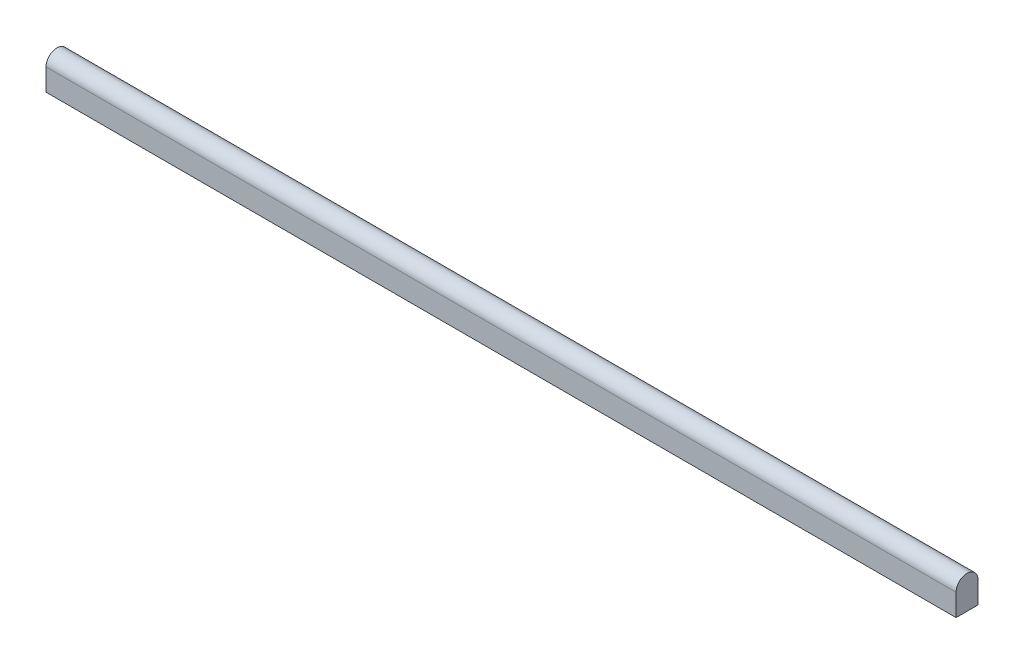
ISO-10303-21;
HEADER;
FILE_DESCRIPTION(('STEP AP214'),'2;1');
FILE_NAME('part.step','',(''),(''),'','','');
FILE_SCHEMA(('AUTOMOTIVE_DESIGN { 1 0 10303 214 1 1 1 1 }'));
ENDSEC;
DATA;
#1=APPLICATION_CONTEXT('core data for automotive mechanical design processes');
#2=APPLICATION_PROTOCOL_DEFINITION('international standard','automotive_design',2000,#1);
#3=PRODUCT_CONTEXT('',#1,'mechanical');
#4=PRODUCT('Part','Part','',(#3));
#5=PRODUCT_RELATED_PRODUCT_CATEGORY('part','',(#4));
#6=PRODUCT_DEFINITION_FORMATION('','',#4);
#7=PRODUCT_DEFINITION_CONTEXT('part definition',#1,'design');
#8=PRODUCT_DEFINITION('design','',#6,#7);
#9=PRODUCT_DEFINITION_SHAPE('','',#8);
#10=(LENGTH_UNIT() NAMED_UNIT(*) SI_UNIT(.MILLI.,.METRE.));
#11=(NAMED_UNIT(*) PLANE_ANGLE_UNIT() SI_UNIT($,.RADIAN.));
#12=(NAMED_UNIT(*) SI_UNIT($,.STERADIAN.) SOLID_ANGLE_UNIT());
#13=UNCERTAINTY_MEASURE_WITH_UNIT(LENGTH_MEASURE(1.E-05),#10,'distance_accuracy_value','');
#14=(GEOMETRIC_REPRESENTATION_CONTEXT(3) GLOBAL_UNCERTAINTY_ASSIGNED_CONTEXT((#13)) GLOBAL_UNIT_ASSIGNED_CONTEXT((#10,
#11,#12)) REPRESENTATION_CONTEXT('',''));
#15=CARTESIAN_POINT('',(0.,0.,0.));
#16=DIRECTION('',(0.,0.,1.));
#17=DIRECTION('',(1.,0.,0.));
#18=AXIS2_PLACEMENT_3D('',#15,#16,#17);
#19=CARTESIAN_POINT('',(10.,-3.,-1.));
#20=DIRECTION('',(0.,-1.,0.));
#21=DIRECTION('',(0.,0.,-1.));
#22=AXIS2_PLACEMENT_3D('',#19,#20,#21);
#23=PLANE('',#22);
#24=DIRECTION('',(0.,0.,1.));
#25=VECTOR('',#24,1.);
#26=CARTESIAN_POINT('',(10.,-3.,-1.));
#27=LINE('',#26,#25);
#28=CARTESIAN_POINT('',(10.,-3.,0.500000000000004));
#29=VERTEX_POINT('',#28);
#30=CARTESIAN_POINT('',(10.,-3.,1.));
#31=VERTEX_POINT('',#30);
#32=EDGE_CURVE('E213',#29,#31,#27,.T.);
#33=ORIENTED_EDGE('',*,*,#32,.F.);
#34=DIRECTION('',(-1.,0.,0.));
#35=VECTOR('',#34,1.);
#36=CARTESIAN_POINT('',(10.,-3.,0.500000000000004));
#37=LINE('',#36,#35);
#38=CARTESIAN_POINT('',(0.,-3.,0.5));
#39=VERTEX_POINT('',#38);
#40=EDGE_CURVE('E194',#29,#39,#37,.T.);
#41=ORIENTED_EDGE('',*,*,#40,.T.);
#42=DIRECTION('',(0.,0.,1.));
#43=VECTOR('',#42,1.);
#44=CARTESIAN_POINT('',(0.,-3.,-1.));
#45=LINE('',#44,#43);
#46=CARTESIAN_POINT('',(0.,-3.,1.));
#47=VERTEX_POINT('',#46);
#48=EDGE_CURVE('E186',#39,#47,#45,.T.);
#49=ORIENTED_EDGE('',*,*,#48,.T.);
#50=DIRECTION('',(-1.,0.,0.));
#51=VECTOR('',#50,1.);
#52=CARTESIAN_POINT('',(10.,-3.,1.));
#53=LINE('',#52,#51);
#54=EDGE_CURVE('E238',#31,#47,#53,.T.);
#55=ORIENTED_EDGE('',*,*,#54,.F.);
#56=EDGE_LOOP('',(#33,#41,#49,#55));
#57=FACE_BOUND('',#56,.T.);
#58=ADVANCED_FACE('F39',(#57),#23,.F.);
#59=CARTESIAN_POINT('',(166.,0.,0.));
#60=DIRECTION('',(-1.,0.,0.));
#61=DIRECTION('',(0.,0.,1.));
#62=AXIS2_PLACEMENT_3D('',#59,#60,#61);
#63=CYLINDRICAL_SURFACE('',#62,2.);
#64=CARTESIAN_POINT('',(0.,0.,0.));
#65=DIRECTION('',(1.,0.,0.));
#66=DIRECTION('',(0.,0.,1.));
#67=AXIS2_PLACEMENT_3D('',#64,#65,#66);
#68=CIRCLE('',#67,2.);
#69=CARTESIAN_POINT('',(0.,0.,-2.));
#70=VERTEX_POINT('',#69);
#71=CARTESIAN_POINT('',(0.,0.,2.));
#72=VERTEX_POINT('',#71);
#73=EDGE_CURVE('E162',#70,#72,#68,.T.);
#74=ORIENTED_EDGE('',*,*,#73,.T.);
#75=DIRECTION('',(-1.,0.,0.));
#76=VECTOR('',#75,1.);
#77=CARTESIAN_POINT('',(166.,0.,2.));
#78=LINE('',#77,#76);
#79=CARTESIAN_POINT('',(166.,0.,2.));
#80=VERTEX_POINT('',#79);
#81=EDGE_CURVE('E11',#80,#72,#78,.T.);
#82=ORIENTED_EDGE('',*,*,#81,.F.);
#83=CARTESIAN_POINT('',(166.,0.,0.));
#84=DIRECTION('',(1.,0.,0.));
#85=DIRECTION('',(0.,0.,1.));
#86=AXIS2_PLACEMENT_3D('',#83,#84,#85);
#87=CIRCLE('',#86,2.);
#88=CARTESIAN_POINT('',(166.,0.,-2.));
#89=VERTEX_POINT('',#88);
#90=EDGE_CURVE('E168',#89,#80,#87,.T.);
#91=ORIENTED_EDGE('',*,*,#90,.F.);
#92=DIRECTION('',(-1.,0.,0.));
#93=VECTOR('',#92,1.);
#94=CARTESIAN_POINT('',(166.,0.,-2.));
#95=LINE('',#94,#93);
#96=EDGE_CURVE('E169',#89,#70,#95,.T.);
#97=ORIENTED_EDGE('',*,*,#96,.T.);
#98=EDGE_LOOP('',(#74,#82,#91,#97));
#99=FACE_BOUND('',#98,.T.);
#100=ADVANCED_FACE('F41',(#99),#63,.T.);
#101=CARTESIAN_POINT('',(166.,0.,2.));
#102=DIRECTION('',(0.,0.,-1.));
#103=DIRECTION('',(0.,1.,0.));
#104=AXIS2_PLACEMENT_3D('',#101,#102,#103);
#105=PLANE('',#104);
#106=DIRECTION('',(0.,-1.,0.));
#107=VECTOR('',#106,1.);
#108=CARTESIAN_POINT('',(0.,0.,2.));
#109=LINE('',#108,#107);
#110=CARTESIAN_POINT('',(0.,-4.,2.));
#111=VERTEX_POINT('',#110);
#112=EDGE_CURVE('E158',#72,#111,#109,.T.);
#113=ORIENTED_EDGE('',*,*,#112,.T.);
#114=DIRECTION('',(-1.,0.,0.));
#115=VECTOR('',#114,1.);
#116=CARTESIAN_POINT('',(166.,-4.,2.));
#117=LINE('',#116,#115);
#118=CARTESIAN_POINT('',(166.,-4.,2.));
#119=VERTEX_POINT('',#118);
#120=EDGE_CURVE('E48',#119,#111,#117,.T.);
#121=ORIENTED_EDGE('',*,*,#120,.F.);
#122=DIRECTION('',(0.,-1.,0.));
#123=VECTOR('',#122,1.);
#124=CARTESIAN_POINT('',(166.,0.,2.));
#125=LINE('',#124,#123);
#126=EDGE_CURVE('E250',#80,#119,#125,.T.);
#127=ORIENTED_EDGE('',*,*,#126,.F.);
#128=ORIENTED_EDGE('',*,*,#81,.T.);
#129=EDGE_LOOP('',(#113,#121,#127,#128));
#130=FACE_BOUND('',#129,.T.);
#131=ADVANCED_FACE('F267',(#130),#105,.F.);
#132=CARTESIAN_POINT('',(166.,-4.,2.));
#133=DIRECTION('',(0.,1.,0.));
#134=DIRECTION('',(0.,0.,1.));
#135=AXIS2_PLACEMENT_3D('',#132,#133,#134);
#136=PLANE('',#135);
#137=DIRECTION('',(0.,0.,-1.));
#138=VECTOR('',#137,1.);
#139=CARTESIAN_POINT('',(0.,-4.,2.));
#140=LINE('',#139,#138);
#141=CARTESIAN_POINT('',(0.,-4.,0.5));
#142=VERTEX_POINT('',#141);
#143=EDGE_CURVE('E157',#111,#142,#140,.T.);
#144=ORIENTED_EDGE('',*,*,#143,.T.);
#145=DIRECTION('',(-1.,0.,0.));
#146=VECTOR('',#145,1.);
#147=CARTESIAN_POINT('',(0.,-4.,0.5));
#148=LINE('',#147,#146);
#149=CARTESIAN_POINT('',(10.,-4.,0.500000000000004));
#150=VERTEX_POINT('',#149);
#151=EDGE_CURVE('E138',#150,#142,#148,.T.);
#152=ORIENTED_EDGE('',*,*,#151,.F.);
#153=DIRECTION('',(0.,0.,1.));
#154=VECTOR('',#153,1.);
#155=CARTESIAN_POINT('',(10.,-4.,-0.5));
#156=LINE('',#155,#154);
#157=CARTESIAN_POINT('',(10.,-4.,-0.5));
#158=VERTEX_POINT('',#157);
#159=EDGE_CURVE('E148',#158,#150,#156,.T.);
#160=ORIENTED_EDGE('',*,*,#159,.F.);
#161=DIRECTION('',(1.,0.,0.));
#162=VECTOR('',#161,1.);
#163=CARTESIAN_POINT('',(0.,-4.,-0.5));
#164=LINE('',#163,#162);
#165=CARTESIAN_POINT('',(0.,-4.,-0.5));
#166=VERTEX_POINT('',#165);
#167=EDGE_CURVE('E130',#166,#158,#164,.T.);
#168=ORIENTED_EDGE('',*,*,#167,.F.);
#169=CARTESIAN_POINT('',(0.,-4.,-2.));
#170=VERTEX_POINT('',#169);
#171=EDGE_CURVE('E144',#166,#170,#140,.T.);
#172=ORIENTED_EDGE('',*,*,#171,.T.);
#173=DIRECTION('',(-1.,0.,0.));
#174=VECTOR('',#173,1.);
#175=CARTESIAN_POINT('',(166.,-4.,-2.));
#176=LINE('',#175,#174);
#177=CARTESIAN_POINT('',(166.,-4.,-2.));
#178=VERTEX_POINT('',#177);
#179=EDGE_CURVE('E173',#178,#170,#176,.T.);
#180=ORIENTED_EDGE('',*,*,#179,.F.);
#181=DIRECTION('',(0.,0.,-1.));
#182=VECTOR('',#181,1.);
#183=CARTESIAN_POINT('',(166.,-4.,2.));
#184=LINE('',#183,#182);
#185=EDGE_CURVE('E181',#119,#178,#184,.T.);
#186=ORIENTED_EDGE('',*,*,#185,.F.);
#187=ORIENTED_EDGE('',*,*,#120,.T.);
#188=EDGE_LOOP('',(#144,#152,#160,#168,#172,#180,#186,#187));
#189=FACE_BOUND('',#188,.T.);
#190=ADVANCED_FACE('F142',(#189),#136,.F.);
#191=CARTESIAN_POINT('',(166.,-4.,-2.));
#192=DIRECTION('',(0.,0.,1.));
#193=DIRECTION('',(0.,-1.,0.));
#194=AXIS2_PLACEMENT_3D('',#191,#192,#193);
#195=PLANE('',#194);
#196=DIRECTION('',(0.,1.,0.));
#197=VECTOR('',#196,1.);
#198=CARTESIAN_POINT('',(0.,-4.,-2.));
#199=LINE('',#198,#197);
#200=EDGE_CURVE('E155',#170,#70,#199,.T.);
#201=ORIENTED_EDGE('',*,*,#200,.T.);
#202=ORIENTED_EDGE('',*,*,#96,.F.);
#203=DIRECTION('',(0.,1.,0.));
#204=VECTOR('',#203,1.);
#205=CARTESIAN_POINT('',(166.,-4.,-2.));
#206=LINE('',#205,#204);
#207=EDGE_CURVE('E174',#178,#89,#206,.T.);
#208=ORIENTED_EDGE('',*,*,#207,.F.);
#209=ORIENTED_EDGE('',*,*,#179,.T.);
#210=EDGE_LOOP('',(#201,#202,#208,#209));
#211=FACE_BOUND('',#210,.T.);
#212=ADVANCED_FACE('F264',(#211),#195,.F.);
#213=CARTESIAN_POINT('',(166.,0.,0.));
#214=DIRECTION('',(-1.,0.,0.));
#215=DIRECTION('',(0.,0.,1.));
#216=AXIS2_PLACEMENT_3D('',#213,#214,#215);
#217=PLANE('',#216);
#218=ORIENTED_EDGE('',*,*,#90,.T.);
#219=ORIENTED_EDGE('',*,*,#126,.T.);
#220=ORIENTED_EDGE('',*,*,#185,.T.);
#221=ORIENTED_EDGE('',*,*,#207,.T.);
#222=EDGE_LOOP('',(#218,#219,#220,#221));
#223=FACE_BOUND('',#222,.T.);
#224=ADVANCED_FACE('F266',(#223),#217,.F.);
#225=CARTESIAN_POINT('',(0.,0.,0.));
#226=DIRECTION('',(-1.,0.,0.));
#227=DIRECTION('',(0.,0.,1.));
#228=AXIS2_PLACEMENT_3D('',#225,#226,#227);
#229=PLANE('',#228);
#230=DIRECTION('',(0.,-1.,0.));
#231=VECTOR('',#230,1.);
#232=CARTESIAN_POINT('',(0.,-2.,0.5));
#233=LINE('',#232,#231);
#234=EDGE_CURVE('E184',#39,#142,#233,.T.);
#235=ORIENTED_EDGE('',*,*,#234,.T.);
#236=ORIENTED_EDGE('',*,*,#143,.F.);
#237=ORIENTED_EDGE('',*,*,#112,.F.);
#238=ORIENTED_EDGE('',*,*,#73,.F.);
#239=ORIENTED_EDGE('',*,*,#200,.F.);
#240=ORIENTED_EDGE('',*,*,#171,.F.);
#241=DIRECTION('',(0.,-1.,0.));
#242=VECTOR('',#241,1.);
#243=CARTESIAN_POINT('',(0.,-2.,-0.5));
#244=LINE('',#243,#242);
#245=CARTESIAN_POINT('',(0.,-3.,-0.5));
#246=VERTEX_POINT('',#245);
#247=EDGE_CURVE('E127',#246,#166,#244,.T.);
#248=ORIENTED_EDGE('',*,*,#247,.F.);
#249=CARTESIAN_POINT('',(0.,-3.,-1.));
#250=VERTEX_POINT('',#249);
#251=EDGE_CURVE('E229',#250,#246,#45,.T.);
#252=ORIENTED_EDGE('',*,*,#251,.F.);
#253=DIRECTION('',(0.,-1.,0.));
#254=VECTOR('',#253,1.);
#255=CARTESIAN_POINT('',(0.,0.,-1.));
#256=LINE('',#255,#254);
#257=CARTESIAN_POINT('',(0.,0.,-1.));
#258=VERTEX_POINT('',#257);
#259=EDGE_CURVE('E225',#258,#250,#256,.T.);
#260=ORIENTED_EDGE('',*,*,#259,.F.);
#261=CARTESIAN_POINT('',(0.,0.,0.));
#262=DIRECTION('',(-1.,0.,0.));
#263=DIRECTION('',(0.,0.,1.));
#264=AXIS2_PLACEMENT_3D('',#261,#262,#263);
#265=CIRCLE('',#264,1.);
#266=CARTESIAN_POINT('',(0.,0.,1.));
#267=VERTEX_POINT('',#266);
#268=EDGE_CURVE('E63',#267,#258,#265,.T.);
#269=ORIENTED_EDGE('',*,*,#268,.F.);
#270=DIRECTION('',(0.,1.,0.));
#271=VECTOR('',#270,1.);
#272=CARTESIAN_POINT('',(0.,-3.,1.));
#273=LINE('',#272,#271);
#274=EDGE_CURVE('E209',#47,#267,#273,.T.);
#275=ORIENTED_EDGE('',*,*,#274,.F.);
#276=ORIENTED_EDGE('',*,*,#48,.F.);
#277=EDGE_LOOP('',(#235,#236,#237,#238,#239,#240,#248,#252,#260,#269,#275,#276));
#278=FACE_BOUND('',#277,.T.);
#279=ADVANCED_FACE('F153',(#278),#229,.T.);
#280=CARTESIAN_POINT('',(10.,0.,0.));
#281=DIRECTION('',(-1.,0.,0.));
#282=DIRECTION('',(0.,0.,1.));
#283=AXIS2_PLACEMENT_3D('',#280,#281,#282);
#284=CYLINDRICAL_SURFACE('',#283,1.);
#285=ORIENTED_EDGE('',*,*,#268,.T.);
#286=DIRECTION('',(-1.,0.,0.));
#287=VECTOR('',#286,1.);
#288=CARTESIAN_POINT('',(10.,0.,-1.));
#289=LINE('',#288,#287);
#290=CARTESIAN_POINT('',(10.,0.,-1.));
#291=VERTEX_POINT('',#290);
#292=EDGE_CURVE('E222',#291,#258,#289,.T.);
#293=ORIENTED_EDGE('',*,*,#292,.F.);
#294=CARTESIAN_POINT('',(10.,0.,0.));
#295=DIRECTION('',(-1.,0.,0.));
#296=DIRECTION('',(0.,0.,1.));
#297=AXIS2_PLACEMENT_3D('',#294,#295,#296);
#298=CIRCLE('',#297,1.);
#299=CARTESIAN_POINT('',(10.,0.,1.));
#300=VERTEX_POINT('',#299);
#301=EDGE_CURVE('E204',#300,#291,#298,.T.);
#302=ORIENTED_EDGE('',*,*,#301,.F.);
#303=DIRECTION('',(-1.,0.,0.));
#304=VECTOR('',#303,1.);
#305=CARTESIAN_POINT('',(10.,0.,1.));
#306=LINE('',#305,#304);
#307=EDGE_CURVE('E235',#300,#267,#306,.T.);
#308=ORIENTED_EDGE('',*,*,#307,.T.);
#309=EDGE_LOOP('',(#285,#293,#302,#308));
#310=FACE_BOUND('',#309,.T.);
#311=ADVANCED_FACE('F293',(#310),#284,.F.);
#312=CARTESIAN_POINT('',(10.,-3.,1.));
#313=DIRECTION('',(0.,0.,1.));
#314=DIRECTION('',(0.,-1.,0.));
#315=AXIS2_PLACEMENT_3D('',#312,#313,#314);
#316=PLANE('',#315);
#317=ORIENTED_EDGE('',*,*,#274,.T.);
#318=ORIENTED_EDGE('',*,*,#307,.F.);
#319=DIRECTION('',(0.,1.,0.));
#320=VECTOR('',#319,1.);
#321=CARTESIAN_POINT('',(10.,-3.,1.));
#322=LINE('',#321,#320);
#323=EDGE_CURVE('E218',#31,#300,#322,.T.);
#324=ORIENTED_EDGE('',*,*,#323,.F.);
#325=ORIENTED_EDGE('',*,*,#54,.T.);
#326=EDGE_LOOP('',(#317,#318,#324,#325));
#327=FACE_BOUND('',#326,.T.);
#328=ADVANCED_FACE('F285',(#327),#316,.F.);
#329=ORIENTED_EDGE('',*,*,#251,.T.);
#330=DIRECTION('',(1.,0.,0.));
#331=VECTOR('',#330,1.);
#332=CARTESIAN_POINT('',(10.,-3.,-0.5));
#333=LINE('',#332,#331);
#334=CARTESIAN_POINT('',(10.,-3.,-0.5));
#335=VERTEX_POINT('',#334);
#336=EDGE_CURVE('E132',#246,#335,#333,.T.);
#337=ORIENTED_EDGE('',*,*,#336,.T.);
#338=CARTESIAN_POINT('',(10.,-3.,-1.));
#339=VERTEX_POINT('',#338);
#340=EDGE_CURVE('E214',#339,#335,#27,.T.);
#341=ORIENTED_EDGE('',*,*,#340,.F.);
#342=DIRECTION('',(-1.,0.,0.));
#343=VECTOR('',#342,1.);
#344=CARTESIAN_POINT('',(10.,-3.,-1.));
#345=LINE('',#344,#343);
#346=EDGE_CURVE('E242',#339,#250,#345,.T.);
#347=ORIENTED_EDGE('',*,*,#346,.T.);
#348=EDGE_LOOP('',(#329,#337,#341,#347));
#349=FACE_BOUND('',#348,.T.);
#350=ADVANCED_FACE('F277',(#349),#23,.F.);
#351=CARTESIAN_POINT('',(10.,0.,-1.));
#352=DIRECTION('',(0.,0.,-1.));
#353=DIRECTION('',(0.,1.,0.));
#354=AXIS2_PLACEMENT_3D('',#351,#352,#353);
#355=PLANE('',#354);
#356=ORIENTED_EDGE('',*,*,#259,.T.);
#357=ORIENTED_EDGE('',*,*,#346,.F.);
#358=DIRECTION('',(0.,-1.,0.));
#359=VECTOR('',#358,1.);
#360=CARTESIAN_POINT('',(10.,0.,-1.));
#361=LINE('',#360,#359);
#362=EDGE_CURVE('E208',#291,#339,#361,.T.);
#363=ORIENTED_EDGE('',*,*,#362,.F.);
#364=ORIENTED_EDGE('',*,*,#292,.T.);
#365=EDGE_LOOP('',(#356,#357,#363,#364));
#366=FACE_BOUND('',#365,.T.);
#367=ADVANCED_FACE('F284',(#366),#355,.F.);
#368=CARTESIAN_POINT('',(10.,0.,0.));
#369=DIRECTION('',(-1.,0.,0.));
#370=DIRECTION('',(0.,0.,1.));
#371=AXIS2_PLACEMENT_3D('',#368,#369,#370);
#372=PLANE('',#371);
#373=ORIENTED_EDGE('',*,*,#340,.T.);
#374=DIRECTION('',(0.,-1.,0.));
#375=VECTOR('',#374,1.);
#376=CARTESIAN_POINT('',(10.,-2.,-0.5));
#377=LINE('',#376,#375);
#378=EDGE_CURVE('E55',#335,#158,#377,.T.);
#379=ORIENTED_EDGE('',*,*,#378,.T.);
#380=ORIENTED_EDGE('',*,*,#159,.T.);
#381=DIRECTION('',(0.,-1.,0.));
#382=VECTOR('',#381,1.);
#383=CARTESIAN_POINT('',(10.,-2.,0.500000000000004));
#384=LINE('',#383,#382);
#385=EDGE_CURVE('E190',#29,#150,#384,.T.);
#386=ORIENTED_EDGE('',*,*,#385,.F.);
#387=ORIENTED_EDGE('',*,*,#32,.T.);
#388=ORIENTED_EDGE('',*,*,#323,.T.);
#389=ORIENTED_EDGE('',*,*,#301,.T.);
#390=ORIENTED_EDGE('',*,*,#362,.T.);
#391=EDGE_LOOP('',(#373,#379,#380,#386,#387,#388,#389,#390));
#392=FACE_BOUND('',#391,.T.);
#393=ADVANCED_FACE('F291',(#392),#372,.T.);
#394=CARTESIAN_POINT('',(0.,-2.,0.5));
#395=DIRECTION('',(0.,0.,1.));
#396=DIRECTION('',(1.,0.,0.));
#397=AXIS2_PLACEMENT_3D('',#394,#395,#396);
#398=PLANE('',#397);
#399=ORIENTED_EDGE('',*,*,#385,.T.);
#400=ORIENTED_EDGE('',*,*,#151,.T.);
#401=ORIENTED_EDGE('',*,*,#234,.F.);
#402=ORIENTED_EDGE('',*,*,#40,.F.);
#403=EDGE_LOOP('',(#399,#400,#401,#402));
#404=FACE_BOUND('',#403,.T.);
#405=ADVANCED_FACE('F305',(#404),#398,.F.);
#406=CARTESIAN_POINT('',(0.,-2.,-0.5));
#407=DIRECTION('',(0.,0.,-1.));
#408=DIRECTION('',(-1.,0.,0.));
#409=AXIS2_PLACEMENT_3D('',#406,#407,#408);
#410=PLANE('',#409);
#411=ORIENTED_EDGE('',*,*,#247,.T.);
#412=ORIENTED_EDGE('',*,*,#167,.T.);
#413=ORIENTED_EDGE('',*,*,#378,.F.);
#414=ORIENTED_EDGE('',*,*,#336,.F.);
#415=EDGE_LOOP('',(#411,#412,#413,#414));
#416=FACE_BOUND('',#415,.T.);
#417=ADVANCED_FACE('F129',(#416),#410,.F.);
#418=CLOSED_SHELL('',(#58,#100,#131,#190,#212,#224,#279,#311,#328,#350,#367,#393,#405,#417));
#419=MANIFOLD_SOLID_BREP('B2',#418);
#420=ADVANCED_BREP_SHAPE_REPRESENTATION('',(#18,#419),#14);
#421=SHAPE_DEFINITION_REPRESENTATION(#9,#420);
ENDSEC;
END-ISO-10303-21;
